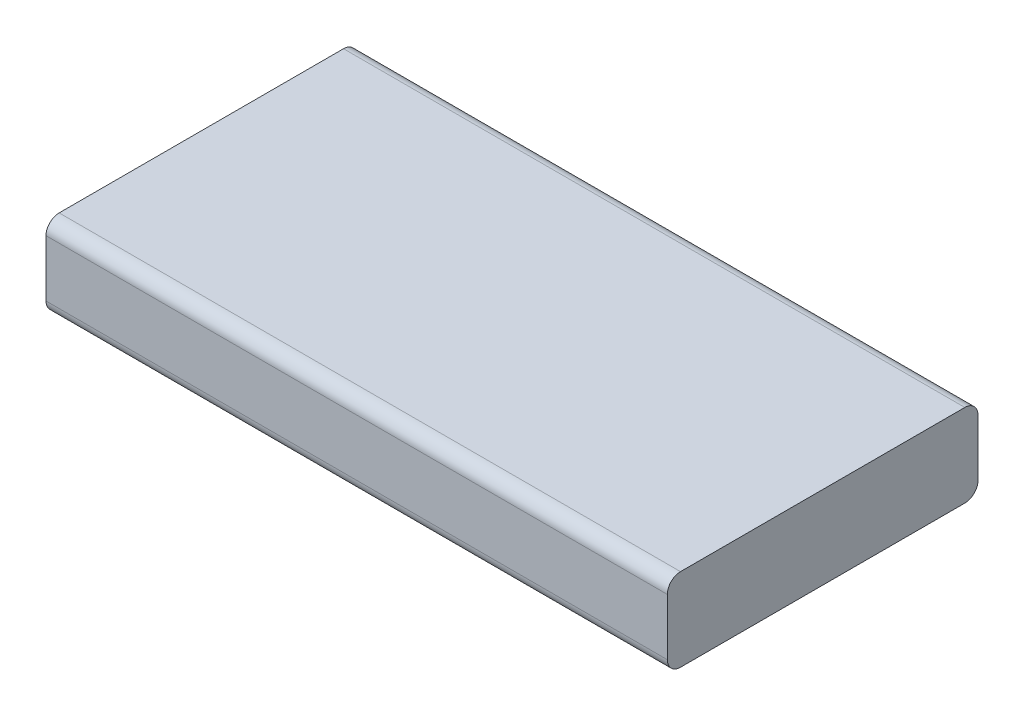
ISO-10303-21;
HEADER;
FILE_DESCRIPTION(('STEP AP214'),'2;1');
FILE_NAME('part.step','',(''),(''),'','','');
FILE_SCHEMA(('AUTOMOTIVE_DESIGN { 1 0 10303 214 1 1 1 1 }'));
ENDSEC;
DATA;
#1=APPLICATION_CONTEXT('core data for automotive mechanical design processes');
#2=APPLICATION_PROTOCOL_DEFINITION('international standard','automotive_design',2000,#1);
#3=PRODUCT_CONTEXT('',#1,'mechanical');
#4=PRODUCT('Part','Part','',(#3));
#5=PRODUCT_RELATED_PRODUCT_CATEGORY('part','',(#4));
#6=PRODUCT_DEFINITION_FORMATION('','',#4);
#7=PRODUCT_DEFINITION_CONTEXT('part definition',#1,'design');
#8=PRODUCT_DEFINITION('design','',#6,#7);
#9=PRODUCT_DEFINITION_SHAPE('','',#8);
#10=(LENGTH_UNIT() NAMED_UNIT(*) SI_UNIT(.MILLI.,.METRE.));
#11=(NAMED_UNIT(*) PLANE_ANGLE_UNIT() SI_UNIT($,.RADIAN.));
#12=(NAMED_UNIT(*) SI_UNIT($,.STERADIAN.) SOLID_ANGLE_UNIT());
#13=UNCERTAINTY_MEASURE_WITH_UNIT(LENGTH_MEASURE(1.E-05),#10,'distance_accuracy_value','');
#14=(GEOMETRIC_REPRESENTATION_CONTEXT(3) GLOBAL_UNCERTAINTY_ASSIGNED_CONTEXT((#13)) GLOBAL_UNIT_ASSIGNED_CONTEXT((#10,
#11,#12)) REPRESENTATION_CONTEXT('',''));
#15=CARTESIAN_POINT('',(0.,0.,0.));
#16=DIRECTION('',(0.,0.,1.));
#17=DIRECTION('',(1.,0.,0.));
#18=AXIS2_PLACEMENT_3D('',#15,#16,#17);
#19=CARTESIAN_POINT('',(0.,4.,0.));
#20=DIRECTION('',(1.,0.,0.));
#21=DIRECTION('',(0.,0.,-1.));
#22=AXIS2_PLACEMENT_3D('',#19,#20,#21);
#23=PLANE('',#22);
#24=DIRECTION('',(0.,-1.,0.));
#25=VECTOR('',#24,1.);
#26=CARTESIAN_POINT('',(0.,4.,-15.));
#27=LINE('',#26,#25);
#28=CARTESIAN_POINT('',(0.,3.365,-15.));
#29=VERTEX_POINT('',#28);
#30=CARTESIAN_POINT('',(0.,0.635,-15.));
#31=VERTEX_POINT('',#30);
#32=EDGE_CURVE('E128',#29,#31,#27,.T.);
#33=ORIENTED_EDGE('',*,*,#32,.T.);
#34=CARTESIAN_POINT('',(0.,0.635,-14.365));
#35=DIRECTION('',(1.,0.,0.));
#36=DIRECTION('',(0.,0.,-1.));
#37=AXIS2_PLACEMENT_3D('',#34,#35,#36);
#38=CIRCLE('',#37,0.635);
#39=CARTESIAN_POINT('',(0.,0.,-14.365));
#40=VERTEX_POINT('',#39);
#41=EDGE_CURVE('E136',#31,#40,#38,.F.);
#42=ORIENTED_EDGE('',*,*,#41,.T.);
#43=DIRECTION('',(0.,0.,1.));
#44=VECTOR('',#43,1.);
#45=CARTESIAN_POINT('',(0.,0.,0.));
#46=LINE('',#45,#44);
#47=CARTESIAN_POINT('',(0.,0.,-0.635));
#48=VERTEX_POINT('',#47);
#49=EDGE_CURVE('E211',#40,#48,#46,.T.);
#50=ORIENTED_EDGE('',*,*,#49,.T.);
#51=CARTESIAN_POINT('',(0.,0.635,-0.635));
#52=DIRECTION('',(1.,0.,0.));
#53=DIRECTION('',(0.,0.,-1.));
#54=AXIS2_PLACEMENT_3D('',#51,#52,#53);
#55=CIRCLE('',#54,0.635);
#56=CARTESIAN_POINT('',(0.,0.635,0.));
#57=VERTEX_POINT('',#56);
#58=EDGE_CURVE('E137',#48,#57,#55,.F.);
#59=ORIENTED_EDGE('',*,*,#58,.T.);
#60=DIRECTION('',(0.,-1.,0.));
#61=VECTOR('',#60,1.);
#62=CARTESIAN_POINT('',(0.,4.,0.));
#63=LINE('',#62,#61);
#64=CARTESIAN_POINT('',(0.,3.365,0.));
#65=VERTEX_POINT('',#64);
#66=EDGE_CURVE('E155',#65,#57,#63,.T.);
#67=ORIENTED_EDGE('',*,*,#66,.F.);
#68=CARTESIAN_POINT('',(0.,3.365,-0.635));
#69=DIRECTION('',(1.,0.,0.));
#70=DIRECTION('',(0.,0.,-1.));
#71=AXIS2_PLACEMENT_3D('',#68,#69,#70);
#72=CIRCLE('',#71,0.635);
#73=CARTESIAN_POINT('',(0.,4.,-0.635));
#74=VERTEX_POINT('',#73);
#75=EDGE_CURVE('E159',#65,#74,#72,.F.);
#76=ORIENTED_EDGE('',*,*,#75,.T.);
#77=DIRECTION('',(0.,0.,1.));
#78=VECTOR('',#77,1.);
#79=CARTESIAN_POINT('',(0.,4.,0.));
#80=LINE('',#79,#78);
#81=CARTESIAN_POINT('',(0.,4.,-14.365));
#82=VERTEX_POINT('',#81);
#83=EDGE_CURVE('E130',#82,#74,#80,.T.);
#84=ORIENTED_EDGE('',*,*,#83,.F.);
#85=CARTESIAN_POINT('',(0.,3.365,-14.365));
#86=DIRECTION('',(1.,0.,0.));
#87=DIRECTION('',(0.,0.,-1.));
#88=AXIS2_PLACEMENT_3D('',#85,#86,#87);
#89=CIRCLE('',#88,0.635);
#90=EDGE_CURVE('E126',#82,#29,#89,.F.);
#91=ORIENTED_EDGE('',*,*,#90,.T.);
#92=EDGE_LOOP('',(#33,#42,#50,#59,#67,#76,#84,#91));
#93=FACE_BOUND('',#92,.T.);
#94=ADVANCED_FACE('F47',(#93),#23,.F.);
#95=CARTESIAN_POINT('',(0.,4.,0.));
#96=DIRECTION('',(0.,0.,-1.));
#97=DIRECTION('',(-1.,0.,0.));
#98=AXIS2_PLACEMENT_3D('',#95,#96,#97);
#99=PLANE('',#98);
#100=ORIENTED_EDGE('',*,*,#66,.T.);
#101=DIRECTION('',(1.,0.,0.));
#102=VECTOR('',#101,1.);
#103=CARTESIAN_POINT('',(30.,0.635,0.));
#104=LINE('',#103,#102);
#105=CARTESIAN_POINT('',(30.,0.635,0.));
#106=VERTEX_POINT('',#105);
#107=EDGE_CURVE('E11',#57,#106,#104,.T.);
#108=ORIENTED_EDGE('',*,*,#107,.T.);
#109=DIRECTION('',(0.,-1.,0.));
#110=VECTOR('',#109,1.);
#111=CARTESIAN_POINT('',(30.,4.,0.));
#112=LINE('',#111,#110);
#113=CARTESIAN_POINT('',(30.,3.365,0.));
#114=VERTEX_POINT('',#113);
#115=EDGE_CURVE('E163',#114,#106,#112,.T.);
#116=ORIENTED_EDGE('',*,*,#115,.F.);
#117=DIRECTION('',(1.,0.,0.));
#118=VECTOR('',#117,1.);
#119=CARTESIAN_POINT('',(0.,3.365,0.));
#120=LINE('',#119,#118);
#121=EDGE_CURVE('E56',#114,#65,#120,.F.);
#122=ORIENTED_EDGE('',*,*,#121,.T.);
#123=EDGE_LOOP('',(#100,#108,#116,#122));
#124=FACE_BOUND('',#123,.T.);
#125=ADVANCED_FACE('F195',(#124),#99,.F.);
#126=CARTESIAN_POINT('',(30.,4.,0.));
#127=DIRECTION('',(-1.,0.,0.));
#128=DIRECTION('',(0.,0.,1.));
#129=AXIS2_PLACEMENT_3D('',#126,#127,#128);
#130=PLANE('',#129);
#131=DIRECTION('',(0.,0.,-1.));
#132=VECTOR('',#131,1.);
#133=CARTESIAN_POINT('',(30.,0.,0.));
#134=LINE('',#133,#132);
#135=CARTESIAN_POINT('',(30.,0.,-0.635));
#136=VERTEX_POINT('',#135);
#137=CARTESIAN_POINT('',(30.,0.,-14.365));
#138=VERTEX_POINT('',#137);
#139=EDGE_CURVE('E208',#136,#138,#134,.T.);
#140=ORIENTED_EDGE('',*,*,#139,.T.);
#141=CARTESIAN_POINT('',(30.,0.635,-14.365));
#142=DIRECTION('',(-1.,0.,0.));
#143=DIRECTION('',(0.,0.,1.));
#144=AXIS2_PLACEMENT_3D('',#141,#142,#143);
#145=CIRCLE('',#144,0.635);
#146=CARTESIAN_POINT('',(30.,0.635,-15.));
#147=VERTEX_POINT('',#146);
#148=EDGE_CURVE('E183',#138,#147,#145,.F.);
#149=ORIENTED_EDGE('',*,*,#148,.T.);
#150=DIRECTION('',(0.,-1.,0.));
#151=VECTOR('',#150,1.);
#152=CARTESIAN_POINT('',(30.,4.,-15.));
#153=LINE('',#152,#151);
#154=CARTESIAN_POINT('',(30.,3.365,-15.));
#155=VERTEX_POINT('',#154);
#156=EDGE_CURVE('E148',#155,#147,#153,.T.);
#157=ORIENTED_EDGE('',*,*,#156,.F.);
#158=CARTESIAN_POINT('',(30.,3.365,-14.365));
#159=DIRECTION('',(-1.,0.,0.));
#160=DIRECTION('',(0.,0.,1.));
#161=AXIS2_PLACEMENT_3D('',#158,#159,#160);
#162=CIRCLE('',#161,0.635);
#163=CARTESIAN_POINT('',(30.,4.,-14.365));
#164=VERTEX_POINT('',#163);
#165=EDGE_CURVE('E153',#155,#164,#162,.F.);
#166=ORIENTED_EDGE('',*,*,#165,.T.);
#167=DIRECTION('',(0.,0.,-1.));
#168=VECTOR('',#167,1.);
#169=CARTESIAN_POINT('',(30.,4.,0.));
#170=LINE('',#169,#168);
#171=CARTESIAN_POINT('',(30.,4.,-0.635));
#172=VERTEX_POINT('',#171);
#173=EDGE_CURVE('E149',#172,#164,#170,.T.);
#174=ORIENTED_EDGE('',*,*,#173,.F.);
#175=CARTESIAN_POINT('',(30.,3.365,-0.635));
#176=DIRECTION('',(-1.,0.,0.));
#177=DIRECTION('',(0.,0.,1.));
#178=AXIS2_PLACEMENT_3D('',#175,#176,#177);
#179=CIRCLE('',#178,0.635);
#180=EDGE_CURVE('E70',#172,#114,#179,.F.);
#181=ORIENTED_EDGE('',*,*,#180,.T.);
#182=ORIENTED_EDGE('',*,*,#115,.T.);
#183=CARTESIAN_POINT('',(30.,0.635,-0.635));
#184=DIRECTION('',(-1.,0.,0.));
#185=DIRECTION('',(0.,0.,1.));
#186=AXIS2_PLACEMENT_3D('',#183,#184,#185);
#187=CIRCLE('',#186,0.635);
#188=EDGE_CURVE('E63',#106,#136,#187,.F.);
#189=ORIENTED_EDGE('',*,*,#188,.T.);
#190=EDGE_LOOP('',(#140,#149,#157,#166,#174,#181,#182,#189));
#191=FACE_BOUND('',#190,.T.);
#192=ADVANCED_FACE('F205',(#191),#130,.F.);
#193=CARTESIAN_POINT('',(0.,4.,-15.));
#194=DIRECTION('',(0.,0.,1.));
#195=DIRECTION('',(1.,0.,0.));
#196=AXIS2_PLACEMENT_3D('',#193,#194,#195);
#197=PLANE('',#196);
#198=ORIENTED_EDGE('',*,*,#156,.T.);
#199=DIRECTION('',(-1.,0.,0.));
#200=VECTOR('',#199,1.);
#201=CARTESIAN_POINT('',(0.,0.635,-15.));
#202=LINE('',#201,#200);
#203=EDGE_CURVE('E146',#147,#31,#202,.T.);
#204=ORIENTED_EDGE('',*,*,#203,.T.);
#205=ORIENTED_EDGE('',*,*,#32,.F.);
#206=DIRECTION('',(-1.,0.,0.));
#207=VECTOR('',#206,1.);
#208=CARTESIAN_POINT('',(0.,3.365,-15.));
#209=LINE('',#208,#207);
#210=EDGE_CURVE('E143',#29,#155,#209,.F.);
#211=ORIENTED_EDGE('',*,*,#210,.T.);
#212=EDGE_LOOP('',(#198,#204,#205,#211));
#213=FACE_BOUND('',#212,.T.);
#214=ADVANCED_FACE('F142',(#213),#197,.F.);
#215=CARTESIAN_POINT('',(0.,4.,0.));
#216=DIRECTION('',(0.,-1.,0.));
#217=DIRECTION('',(0.,0.,-1.));
#218=AXIS2_PLACEMENT_3D('',#215,#216,#217);
#219=PLANE('',#218);
#220=ORIENTED_EDGE('',*,*,#173,.T.);
#221=DIRECTION('',(-1.,0.,0.));
#222=VECTOR('',#221,1.);
#223=CARTESIAN_POINT('',(0.,4.,-14.365));
#224=LINE('',#223,#222);
#225=EDGE_CURVE('E190',#164,#82,#224,.T.);
#226=ORIENTED_EDGE('',*,*,#225,.T.);
#227=ORIENTED_EDGE('',*,*,#83,.T.);
#228=DIRECTION('',(1.,0.,0.));
#229=VECTOR('',#228,1.);
#230=CARTESIAN_POINT('',(0.,4.,-0.635));
#231=LINE('',#230,#229);
#232=EDGE_CURVE('E186',#74,#172,#231,.T.);
#233=ORIENTED_EDGE('',*,*,#232,.T.);
#234=EDGE_LOOP('',(#220,#226,#227,#233));
#235=FACE_BOUND('',#234,.T.);
#236=ADVANCED_FACE('F203',(#235),#219,.F.);
#237=CARTESIAN_POINT('',(0.,0.,0.));
#238=DIRECTION('',(0.,-1.,0.));
#239=DIRECTION('',(0.,0.,-1.));
#240=AXIS2_PLACEMENT_3D('',#237,#238,#239);
#241=PLANE('',#240);
#242=ORIENTED_EDGE('',*,*,#49,.F.);
#243=DIRECTION('',(-1.,0.,0.));
#244=VECTOR('',#243,1.);
#245=CARTESIAN_POINT('',(30.,0.,-14.365));
#246=LINE('',#245,#244);
#247=EDGE_CURVE('E176',#40,#138,#246,.F.);
#248=ORIENTED_EDGE('',*,*,#247,.T.);
#249=ORIENTED_EDGE('',*,*,#139,.F.);
#250=DIRECTION('',(1.,0.,0.));
#251=VECTOR('',#250,1.);
#252=CARTESIAN_POINT('',(0.,0.,-0.635));
#253=LINE('',#252,#251);
#254=EDGE_CURVE('E173',#136,#48,#253,.F.);
#255=ORIENTED_EDGE('',*,*,#254,.T.);
#256=EDGE_LOOP('',(#242,#248,#249,#255));
#257=FACE_BOUND('',#256,.T.);
#258=ADVANCED_FACE('F220',(#257),#241,.T.);
#259=CARTESIAN_POINT('',(0.,0.635,-14.365));
#260=DIRECTION('',(1.,0.,0.));
#261=DIRECTION('',(0.,0.,-1.));
#262=AXIS2_PLACEMENT_3D('',#259,#260,#261);
#263=CYLINDRICAL_SURFACE('',#262,0.635);
#264=ORIENTED_EDGE('',*,*,#148,.F.);
#265=ORIENTED_EDGE('',*,*,#247,.F.);
#266=ORIENTED_EDGE('',*,*,#41,.F.);
#267=ORIENTED_EDGE('',*,*,#203,.F.);
#268=EDGE_LOOP('',(#264,#265,#266,#267));
#269=FACE_BOUND('',#268,.T.);
#270=ADVANCED_FACE('F228',(#269),#263,.T.);
#271=CARTESIAN_POINT('',(0.,3.365,-14.365));
#272=DIRECTION('',(-1.,0.,0.));
#273=DIRECTION('',(0.,0.,1.));
#274=AXIS2_PLACEMENT_3D('',#271,#272,#273);
#275=CYLINDRICAL_SURFACE('',#274,0.635);
#276=ORIENTED_EDGE('',*,*,#165,.F.);
#277=ORIENTED_EDGE('',*,*,#210,.F.);
#278=ORIENTED_EDGE('',*,*,#90,.F.);
#279=ORIENTED_EDGE('',*,*,#225,.F.);
#280=EDGE_LOOP('',(#276,#277,#278,#279));
#281=FACE_BOUND('',#280,.T.);
#282=ADVANCED_FACE('F152',(#281),#275,.T.);
#283=CARTESIAN_POINT('',(0.,0.635,-0.635));
#284=DIRECTION('',(-1.,0.,0.));
#285=DIRECTION('',(0.,0.,1.));
#286=AXIS2_PLACEMENT_3D('',#283,#284,#285);
#287=CYLINDRICAL_SURFACE('',#286,0.635);
#288=ORIENTED_EDGE('',*,*,#58,.F.);
#289=ORIENTED_EDGE('',*,*,#254,.F.);
#290=ORIENTED_EDGE('',*,*,#188,.F.);
#291=ORIENTED_EDGE('',*,*,#107,.F.);
#292=EDGE_LOOP('',(#288,#289,#290,#291));
#293=FACE_BOUND('',#292,.T.);
#294=ADVANCED_FACE('F222',(#293),#287,.T.);
#295=CARTESIAN_POINT('',(0.,3.365,-0.635));
#296=DIRECTION('',(1.,0.,0.));
#297=DIRECTION('',(0.,0.,-1.));
#298=AXIS2_PLACEMENT_3D('',#295,#296,#297);
#299=CYLINDRICAL_SURFACE('',#298,0.635);
#300=ORIENTED_EDGE('',*,*,#75,.F.);
#301=ORIENTED_EDGE('',*,*,#121,.F.);
#302=ORIENTED_EDGE('',*,*,#180,.F.);
#303=ORIENTED_EDGE('',*,*,#232,.F.);
#304=EDGE_LOOP('',(#300,#301,#302,#303));
#305=FACE_BOUND('',#304,.T.);
#306=ADVANCED_FACE('F49',(#305),#299,.T.);
#307=CLOSED_SHELL('',(#94,#125,#192,#214,#236,#258,#270,#282,#294,#306));
#308=MANIFOLD_SOLID_BREP('B2',#307);
#309=ADVANCED_BREP_SHAPE_REPRESENTATION('',(#18,#308),#14);
#310=SHAPE_DEFINITION_REPRESENTATION(#9,#309);
ENDSEC;
END-ISO-10303-21;
